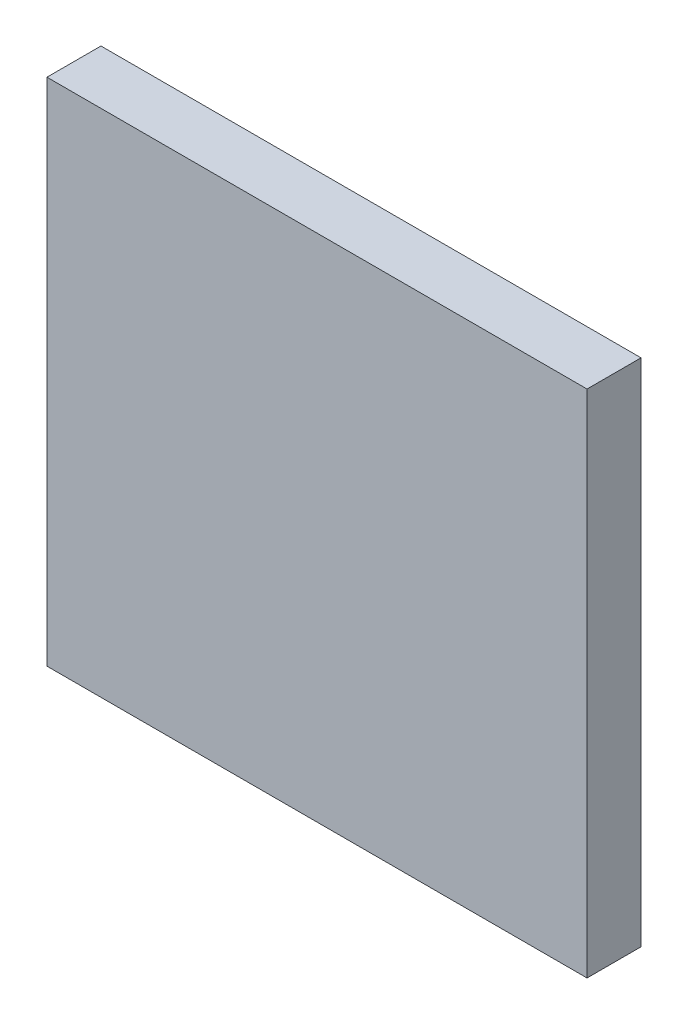
ISO-10303-21;
HEADER;
FILE_DESCRIPTION(('STEP AP214'),'2;1');
FILE_NAME('part.step','',(''),(''),'','','');
FILE_SCHEMA(('AUTOMOTIVE_DESIGN { 1 0 10303 214 1 1 1 1 }'));
ENDSEC;
DATA;
#1=APPLICATION_CONTEXT('core data for automotive mechanical design processes');
#2=APPLICATION_PROTOCOL_DEFINITION('international standard','automotive_design',2000,#1);
#3=PRODUCT_CONTEXT('',#1,'mechanical');
#4=PRODUCT('Part','Part','',(#3));
#5=PRODUCT_RELATED_PRODUCT_CATEGORY('part','',(#4));
#6=PRODUCT_DEFINITION_FORMATION('','',#4);
#7=PRODUCT_DEFINITION_CONTEXT('part definition',#1,'design');
#8=PRODUCT_DEFINITION('design','',#6,#7);
#9=PRODUCT_DEFINITION_SHAPE('','',#8);
#10=(LENGTH_UNIT() NAMED_UNIT(*) SI_UNIT(.MILLI.,.METRE.));
#11=(NAMED_UNIT(*) PLANE_ANGLE_UNIT() SI_UNIT($,.RADIAN.));
#12=(NAMED_UNIT(*) SI_UNIT($,.STERADIAN.) SOLID_ANGLE_UNIT());
#13=UNCERTAINTY_MEASURE_WITH_UNIT(LENGTH_MEASURE(1.E-05),#10,'distance_accuracy_value','');
#14=(GEOMETRIC_REPRESENTATION_CONTEXT(3) GLOBAL_UNCERTAINTY_ASSIGNED_CONTEXT((#13)) GLOBAL_UNIT_ASSIGNED_CONTEXT((#10,
#11,#12)) REPRESENTATION_CONTEXT('',''));
#15=CARTESIAN_POINT('',(0.,0.,0.));
#16=DIRECTION('',(0.,0.,1.));
#17=DIRECTION('',(1.,0.,0.));
#18=AXIS2_PLACEMENT_3D('',#15,#16,#17);
#19=CARTESIAN_POINT('',(177.747935180771,-10.1342916865305,18.0000000000001));
#20=DIRECTION('',(-1.,0.,0.));
#21=DIRECTION('',(0.,0.,1.));
#22=AXIS2_PLACEMENT_3D('',#19,#20,#21);
#23=PLANE('',#22);
#24=DIRECTION('',(0.,1.,0.));
#25=VECTOR('',#24,1.);
#26=CARTESIAN_POINT('',(177.747935180771,-10.1342916865305,0.));
#27=LINE('',#26,#25);
#28=CARTESIAN_POINT('',(177.747935180771,-10.1342916865305,0.));
#29=VERTEX_POINT('',#28);
#30=CARTESIAN_POINT('',(177.747935180771,159.865708313469,0.));
#31=VERTEX_POINT('',#30);
#32=EDGE_CURVE('E94',#29,#31,#27,.T.);
#33=ORIENTED_EDGE('',*,*,#32,.T.);
#34=DIRECTION('',(0.,0.,-1.));
#35=VECTOR('',#34,1.);
#36=CARTESIAN_POINT('',(177.747935180771,159.865708313469,18.0000000000001));
#37=LINE('',#36,#35);
#38=CARTESIAN_POINT('',(177.747935180771,159.865708313469,18.0000000000001));
#39=VERTEX_POINT('',#38);
#40=EDGE_CURVE('E11',#39,#31,#37,.T.);
#41=ORIENTED_EDGE('',*,*,#40,.F.);
#42=DIRECTION('',(0.,1.,0.));
#43=VECTOR('',#42,1.);
#44=CARTESIAN_POINT('',(177.747935180771,-10.1342916865305,18.0000000000001));
#45=LINE('',#44,#43);
#46=CARTESIAN_POINT('',(177.747935180771,-10.1342916865305,18.0000000000001));
#47=VERTEX_POINT('',#46);
#48=EDGE_CURVE('E82',#47,#39,#45,.T.);
#49=ORIENTED_EDGE('',*,*,#48,.F.);
#50=DIRECTION('',(0.,0.,-1.));
#51=VECTOR('',#50,1.);
#52=CARTESIAN_POINT('',(177.747935180771,-10.1342916865305,18.0000000000001));
#53=LINE('',#52,#51);
#54=EDGE_CURVE('E90',#47,#29,#53,.T.);
#55=ORIENTED_EDGE('',*,*,#54,.T.);
#56=EDGE_LOOP('',(#33,#41,#49,#55));
#57=FACE_BOUND('',#56,.T.);
#58=ADVANCED_FACE('F31',(#57),#23,.F.);
#59=CARTESIAN_POINT('',(177.747935180771,159.865708313469,18.0000000000001));
#60=DIRECTION('',(0.,-1.,0.));
#61=DIRECTION('',(1.,0.,0.));
#62=AXIS2_PLACEMENT_3D('',#59,#60,#61);
#63=PLANE('',#62);
#64=DIRECTION('',(-1.,0.,0.));
#65=VECTOR('',#64,1.);
#66=CARTESIAN_POINT('',(177.747935180771,159.865708313469,0.));
#67=LINE('',#66,#65);
#68=CARTESIAN_POINT('',(-2.25206481922946,159.865708313469,0.));
#69=VERTEX_POINT('',#68);
#70=EDGE_CURVE('E86',#31,#69,#67,.T.);
#71=ORIENTED_EDGE('',*,*,#70,.T.);
#72=DIRECTION('',(0.,0.,-1.));
#73=VECTOR('',#72,1.);
#74=CARTESIAN_POINT('',(-2.25206481922946,159.865708313469,18.));
#75=LINE('',#74,#73);
#76=CARTESIAN_POINT('',(-2.25206481922946,159.865708313469,18.));
#77=VERTEX_POINT('',#76);
#78=EDGE_CURVE('E39',#77,#69,#75,.T.);
#79=ORIENTED_EDGE('',*,*,#78,.F.);
#80=DIRECTION('',(-1.,0.,0.));
#81=VECTOR('',#80,1.);
#82=CARTESIAN_POINT('',(177.747935180771,159.865708313469,18.0000000000001));
#83=LINE('',#82,#81);
#84=EDGE_CURVE('E77',#39,#77,#83,.T.);
#85=ORIENTED_EDGE('',*,*,#84,.F.);
#86=ORIENTED_EDGE('',*,*,#40,.T.);
#87=EDGE_LOOP('',(#71,#79,#85,#86));
#88=FACE_BOUND('',#87,.T.);
#89=ADVANCED_FACE('F85',(#88),#63,.F.);
#90=CARTESIAN_POINT('',(-2.25206481922902,-10.1342916865305,18.));
#91=DIRECTION('',(1.,0.,0.));
#92=DIRECTION('',(0.,0.,-1.));
#93=AXIS2_PLACEMENT_3D('',#90,#91,#92);
#94=PLANE('',#93);
#95=DIRECTION('',(0.,-1.,0.));
#96=VECTOR('',#95,1.);
#97=CARTESIAN_POINT('',(-2.25206481922902,-10.1342916865305,0.));
#98=LINE('',#97,#96);
#99=CARTESIAN_POINT('',(-2.25206481922902,-10.1342916865305,0.));
#100=VERTEX_POINT('',#99);
#101=EDGE_CURVE('E64',#69,#100,#98,.T.);
#102=ORIENTED_EDGE('',*,*,#101,.T.);
#103=DIRECTION('',(0.,0.,-1.));
#104=VECTOR('',#103,1.);
#105=CARTESIAN_POINT('',(-2.25206481922902,-10.1342916865305,18.));
#106=LINE('',#105,#104);
#107=CARTESIAN_POINT('',(-2.25206481922902,-10.1342916865305,18.));
#108=VERTEX_POINT('',#107);
#109=EDGE_CURVE('E87',#108,#100,#106,.T.);
#110=ORIENTED_EDGE('',*,*,#109,.F.);
#111=DIRECTION('',(0.,-1.,0.));
#112=VECTOR('',#111,1.);
#113=CARTESIAN_POINT('',(-2.25206481922902,-10.1342916865305,18.));
#114=LINE('',#113,#112);
#115=EDGE_CURVE('E80',#77,#108,#114,.T.);
#116=ORIENTED_EDGE('',*,*,#115,.F.);
#117=ORIENTED_EDGE('',*,*,#78,.T.);
#118=EDGE_LOOP('',(#102,#110,#116,#117));
#119=FACE_BOUND('',#118,.T.);
#120=ADVANCED_FACE('F88',(#119),#94,.F.);
#121=CARTESIAN_POINT('',(177.747935180771,-10.1342916865305,18.0000000000001));
#122=DIRECTION('',(0.,1.,0.));
#123=DIRECTION('',(-1.,0.,0.));
#124=AXIS2_PLACEMENT_3D('',#121,#122,#123);
#125=PLANE('',#124);
#126=DIRECTION('',(1.,0.,0.));
#127=VECTOR('',#126,1.);
#128=CARTESIAN_POINT('',(177.747935180771,-10.1342916865305,0.));
#129=LINE('',#128,#127);
#130=EDGE_CURVE('E70',#100,#29,#129,.T.);
#131=ORIENTED_EDGE('',*,*,#130,.T.);
#132=ORIENTED_EDGE('',*,*,#54,.F.);
#133=DIRECTION('',(1.,0.,0.));
#134=VECTOR('',#133,1.);
#135=CARTESIAN_POINT('',(177.747935180771,-10.1342916865305,18.0000000000001));
#136=LINE('',#135,#134);
#137=EDGE_CURVE('E47',#108,#47,#136,.T.);
#138=ORIENTED_EDGE('',*,*,#137,.F.);
#139=ORIENTED_EDGE('',*,*,#109,.T.);
#140=EDGE_LOOP('',(#131,#132,#138,#139));
#141=FACE_BOUND('',#140,.T.);
#142=ADVANCED_FACE('F101',(#141),#125,.F.);
#143=CARTESIAN_POINT('',(0.,0.,18.));
#144=DIRECTION('',(0.,0.,1.));
#145=DIRECTION('',(1.,0.,0.));
#146=AXIS2_PLACEMENT_3D('',#143,#144,#145);
#147=PLANE('',#146);
#148=ORIENTED_EDGE('',*,*,#48,.T.);
#149=ORIENTED_EDGE('',*,*,#84,.T.);
#150=ORIENTED_EDGE('',*,*,#115,.T.);
#151=ORIENTED_EDGE('',*,*,#137,.T.);
#152=EDGE_LOOP('',(#148,#149,#150,#151));
#153=FACE_BOUND('',#152,.T.);
#154=ADVANCED_FACE('F78',(#153),#147,.T.);
#155=CARTESIAN_POINT('',(0.,0.,0.));
#156=DIRECTION('',(0.,0.,1.));
#157=DIRECTION('',(1.,0.,0.));
#158=AXIS2_PLACEMENT_3D('',#155,#156,#157);
#159=PLANE('',#158);
#160=ORIENTED_EDGE('',*,*,#32,.F.);
#161=ORIENTED_EDGE('',*,*,#130,.F.);
#162=ORIENTED_EDGE('',*,*,#101,.F.);
#163=ORIENTED_EDGE('',*,*,#70,.F.);
#164=EDGE_LOOP('',(#160,#161,#162,#163));
#165=FACE_BOUND('',#164,.T.);
#166=ADVANCED_FACE('F104',(#165),#159,.F.);
#167=CLOSED_SHELL('',(#58,#89,#120,#142,#154,#166));
#168=MANIFOLD_SOLID_BREP('B2',#167);
#169=ADVANCED_BREP_SHAPE_REPRESENTATION('',(#18,#168),#14);
#170=SHAPE_DEFINITION_REPRESENTATION(#9,#169);
ENDSEC;
END-ISO-10303-21;
